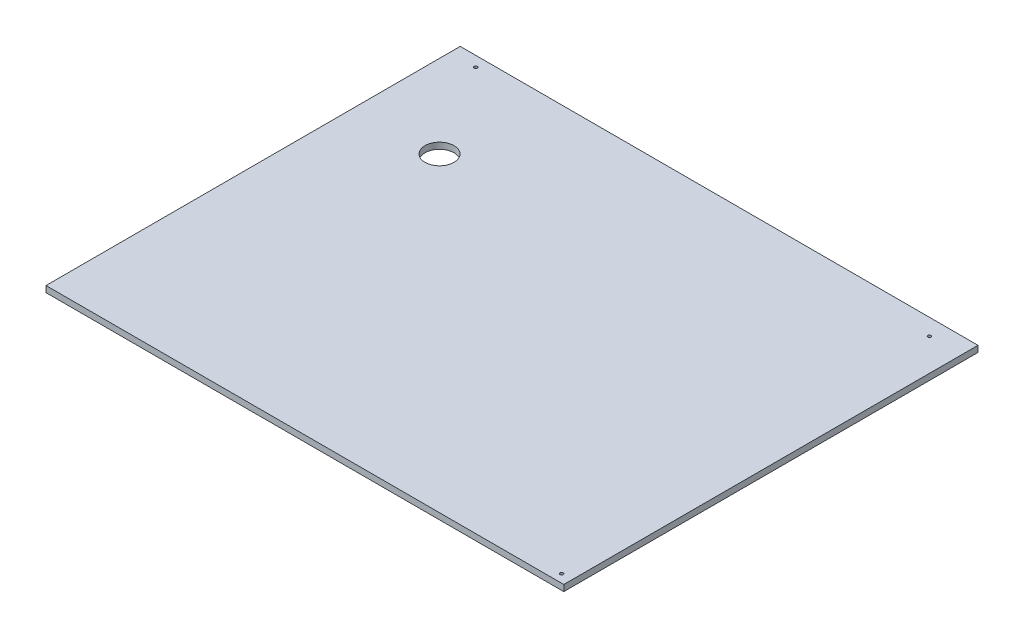
ISO-10303-21;
HEADER;
FILE_DESCRIPTION(('STEP AP214'),'2;1');
FILE_NAME('part.step','',(''),(''),'','','');
FILE_SCHEMA(('AUTOMOTIVE_DESIGN { 1 0 10303 214 1 1 1 1 }'));
ENDSEC;
DATA;
#1=APPLICATION_CONTEXT('core data for automotive mechanical design processes');
#2=APPLICATION_PROTOCOL_DEFINITION('international standard','automotive_design',2000,#1);
#3=PRODUCT_CONTEXT('',#1,'mechanical');
#4=PRODUCT('Part','Part','',(#3));
#5=PRODUCT_RELATED_PRODUCT_CATEGORY('part','',(#4));
#6=PRODUCT_DEFINITION_FORMATION('','',#4);
#7=PRODUCT_DEFINITION_CONTEXT('part definition',#1,'design');
#8=PRODUCT_DEFINITION('design','',#6,#7);
#9=PRODUCT_DEFINITION_SHAPE('','',#8);
#10=(LENGTH_UNIT() NAMED_UNIT(*) SI_UNIT(.MILLI.,.METRE.));
#11=(NAMED_UNIT(*) PLANE_ANGLE_UNIT() SI_UNIT($,.RADIAN.));
#12=(NAMED_UNIT(*) SI_UNIT($,.STERADIAN.) SOLID_ANGLE_UNIT());
#13=UNCERTAINTY_MEASURE_WITH_UNIT(LENGTH_MEASURE(1.E-05),#10,'distance_accuracy_value','');
#14=(GEOMETRIC_REPRESENTATION_CONTEXT(3) GLOBAL_UNCERTAINTY_ASSIGNED_CONTEXT((#13)) GLOBAL_UNIT_ASSIGNED_CONTEXT((#10,
#11,#12)) REPRESENTATION_CONTEXT('',''));
#15=CARTESIAN_POINT('',(0.,0.,0.));
#16=DIRECTION('',(0.,0.,1.));
#17=DIRECTION('',(1.,0.,0.));
#18=AXIS2_PLACEMENT_3D('',#15,#16,#17);
#19=CARTESIAN_POINT('',(0.,6.,0.));
#20=DIRECTION('',(0.,1.,0.));
#21=DIRECTION('',(0.,0.,1.));
#22=AXIS2_PLACEMENT_3D('',#19,#20,#21);
#23=PLANE('',#22);
#24=CARTESIAN_POINT('',(469.,6.,16.));
#25=DIRECTION('',(0.,1.,0.));
#26=DIRECTION('',(0.,0.,1.));
#27=AXIS2_PLACEMENT_3D('',#24,#25,#26);
#28=CIRCLE('',#27,1.50000000000002);
#29=CARTESIAN_POINT('',(469.,6.,17.5));
#30=VERTEX_POINT('',#29);
#31=EDGE_CURVE('E121',#30,#30,#28,.T.);
#32=ORIENTED_EDGE('',*,*,#31,.F.);
#33=EDGE_LOOP('',(#32));
#34=FACE_BOUND('',#33,.T.);
#35=CARTESIAN_POINT('',(25.,6.,10.));
#36=DIRECTION('',(0.,1.,0.));
#37=DIRECTION('',(0.,0.,1.));
#38=AXIS2_PLACEMENT_3D('',#35,#36,#37);
#39=CIRCLE('',#38,1.52499999999999);
#40=CARTESIAN_POINT('',(25.,6.,11.525));
#41=VERTEX_POINT('',#40);
#42=EDGE_CURVE('E100',#41,#41,#39,.T.);
#43=ORIENTED_EDGE('',*,*,#42,.F.);
#44=EDGE_LOOP('',(#43));
#45=FACE_BOUND('',#44,.T.);
#46=DIRECTION('',(0.,0.,1.));
#47=VECTOR('',#46,1.);
#48=CARTESIAN_POINT('',(0.,6.,0.));
#49=LINE('',#48,#47);
#50=CARTESIAN_POINT('',(0.,6.,0.));
#51=VERTEX_POINT('',#50);
#52=CARTESIAN_POINT('',(0.,6.,400.));
#53=VERTEX_POINT('',#52);
#54=EDGE_CURVE('E85',#51,#53,#49,.T.);
#55=ORIENTED_EDGE('',*,*,#54,.T.);
#56=DIRECTION('',(1.,0.,0.));
#57=VECTOR('',#56,1.);
#58=CARTESIAN_POINT('',(0.,6.,400.));
#59=LINE('',#58,#57);
#60=CARTESIAN_POINT('',(500.,6.,400.));
#61=VERTEX_POINT('',#60);
#62=EDGE_CURVE('E80',#53,#61,#59,.T.);
#63=ORIENTED_EDGE('',*,*,#62,.T.);
#64=DIRECTION('',(0.,0.,-1.));
#65=VECTOR('',#64,1.);
#66=CARTESIAN_POINT('',(500.,6.,0.));
#67=LINE('',#66,#65);
#68=CARTESIAN_POINT('',(500.,6.,0.));
#69=VERTEX_POINT('',#68);
#70=EDGE_CURVE('E83',#61,#69,#67,.T.);
#71=ORIENTED_EDGE('',*,*,#70,.T.);
#72=DIRECTION('',(-1.,0.,0.));
#73=VECTOR('',#72,1.);
#74=CARTESIAN_POINT('',(0.,6.,0.));
#75=LINE('',#74,#73);
#76=EDGE_CURVE('E50',#69,#51,#75,.T.);
#77=ORIENTED_EDGE('',*,*,#76,.T.);
#78=EDGE_LOOP('',(#55,#63,#71,#77));
#79=FACE_BOUND('',#78,.T.);
#80=CARTESIAN_POINT('',(490.,6.,392.));
#81=DIRECTION('',(0.,1.,0.));
#82=DIRECTION('',(0.,0.,1.));
#83=AXIS2_PLACEMENT_3D('',#80,#81,#82);
#84=CIRCLE('',#83,1.50000000000002);
#85=CARTESIAN_POINT('',(490.,6.,393.5));
#86=VERTEX_POINT('',#85);
#87=EDGE_CURVE('E115',#86,#86,#84,.T.);
#88=ORIENTED_EDGE('',*,*,#87,.F.);
#89=EDGE_LOOP('',(#88));
#90=FACE_BOUND('',#89,.T.);
#91=CARTESIAN_POINT('',(80.,6.,100.));
#92=DIRECTION('',(0.,1.,0.));
#93=DIRECTION('',(0.,0.,1.));
#94=AXIS2_PLACEMENT_3D('',#91,#92,#93);
#95=CIRCLE('',#94,14.);
#96=CARTESIAN_POINT('',(80.,6.,114.));
#97=VERTEX_POINT('',#96);
#98=EDGE_CURVE('E127',#97,#97,#95,.T.);
#99=ORIENTED_EDGE('',*,*,#98,.F.);
#100=EDGE_LOOP('',(#99));
#101=FACE_BOUND('',#100,.T.);
#102=ADVANCED_FACE('F33',(#34,#45,#79,#90,#101),#23,.T.);
#103=CARTESIAN_POINT('',(0.,0.,0.));
#104=DIRECTION('',(0.,1.,0.));
#105=DIRECTION('',(0.,0.,1.));
#106=AXIS2_PLACEMENT_3D('',#103,#104,#105);
#107=PLANE('',#106);
#108=DIRECTION('',(0.,0.,1.));
#109=VECTOR('',#108,1.);
#110=CARTESIAN_POINT('',(0.,0.,0.));
#111=LINE('',#110,#109);
#112=CARTESIAN_POINT('',(0.,0.,0.));
#113=VERTEX_POINT('',#112);
#114=CARTESIAN_POINT('',(0.,0.,400.));
#115=VERTEX_POINT('',#114);
#116=EDGE_CURVE('E97',#113,#115,#111,.T.);
#117=ORIENTED_EDGE('',*,*,#116,.F.);
#118=DIRECTION('',(-1.,0.,0.));
#119=VECTOR('',#118,1.);
#120=CARTESIAN_POINT('',(0.,0.,0.));
#121=LINE('',#120,#119);
#122=CARTESIAN_POINT('',(500.,0.,0.));
#123=VERTEX_POINT('',#122);
#124=EDGE_CURVE('E73',#123,#113,#121,.T.);
#125=ORIENTED_EDGE('',*,*,#124,.F.);
#126=DIRECTION('',(0.,0.,-1.));
#127=VECTOR('',#126,1.);
#128=CARTESIAN_POINT('',(500.,0.,0.));
#129=LINE('',#128,#127);
#130=CARTESIAN_POINT('',(500.,0.,400.));
#131=VERTEX_POINT('',#130);
#132=EDGE_CURVE('E67',#131,#123,#129,.T.);
#133=ORIENTED_EDGE('',*,*,#132,.F.);
#134=DIRECTION('',(1.,0.,0.));
#135=VECTOR('',#134,1.);
#136=CARTESIAN_POINT('',(0.,0.,400.));
#137=LINE('',#136,#135);
#138=EDGE_CURVE('E89',#115,#131,#137,.T.);
#139=ORIENTED_EDGE('',*,*,#138,.F.);
#140=EDGE_LOOP('',(#117,#125,#133,#139));
#141=FACE_BOUND('',#140,.T.);
#142=CARTESIAN_POINT('',(25.,0.,10.));
#143=DIRECTION('',(0.,1.,0.));
#144=DIRECTION('',(0.,0.,1.));
#145=AXIS2_PLACEMENT_3D('',#142,#143,#144);
#146=CIRCLE('',#145,1.52499999999999);
#147=CARTESIAN_POINT('',(25.,0.,11.525));
#148=VERTEX_POINT('',#147);
#149=EDGE_CURVE('E112',#148,#148,#146,.T.);
#150=ORIENTED_EDGE('',*,*,#149,.T.);
#151=EDGE_LOOP('',(#150));
#152=FACE_BOUND('',#151,.T.);
#153=CARTESIAN_POINT('',(490.,0.,392.));
#154=DIRECTION('',(0.,1.,0.));
#155=DIRECTION('',(0.,0.,1.));
#156=AXIS2_PLACEMENT_3D('',#153,#154,#155);
#157=CIRCLE('',#156,1.50000000000002);
#158=CARTESIAN_POINT('',(490.,0.,393.5));
#159=VERTEX_POINT('',#158);
#160=EDGE_CURVE('E118',#159,#159,#157,.T.);
#161=ORIENTED_EDGE('',*,*,#160,.T.);
#162=EDGE_LOOP('',(#161));
#163=FACE_BOUND('',#162,.T.);
#164=CARTESIAN_POINT('',(469.,0.,16.));
#165=DIRECTION('',(0.,1.,0.));
#166=DIRECTION('',(0.,0.,1.));
#167=AXIS2_PLACEMENT_3D('',#164,#165,#166);
#168=CIRCLE('',#167,1.50000000000002);
#169=CARTESIAN_POINT('',(469.,0.,17.5));
#170=VERTEX_POINT('',#169);
#171=EDGE_CURVE('E124',#170,#170,#168,.T.);
#172=ORIENTED_EDGE('',*,*,#171,.T.);
#173=EDGE_LOOP('',(#172));
#174=FACE_BOUND('',#173,.T.);
#175=CARTESIAN_POINT('',(80.,0.,100.));
#176=DIRECTION('',(0.,1.,0.));
#177=DIRECTION('',(0.,0.,1.));
#178=AXIS2_PLACEMENT_3D('',#175,#176,#177);
#179=CIRCLE('',#178,14.);
#180=CARTESIAN_POINT('',(80.,0.,114.));
#181=VERTEX_POINT('',#180);
#182=EDGE_CURVE('E130',#181,#181,#179,.T.);
#183=ORIENTED_EDGE('',*,*,#182,.T.);
#184=EDGE_LOOP('',(#183));
#185=FACE_BOUND('',#184,.T.);
#186=ADVANCED_FACE('F108',(#141,#152,#163,#174,#185),#107,.F.);
#187=CARTESIAN_POINT('',(0.,6.,0.));
#188=DIRECTION('',(1.,0.,0.));
#189=DIRECTION('',(0.,0.,-1.));
#190=AXIS2_PLACEMENT_3D('',#187,#188,#189);
#191=PLANE('',#190);
#192=ORIENTED_EDGE('',*,*,#116,.T.);
#193=DIRECTION('',(0.,-1.,0.));
#194=VECTOR('',#193,1.);
#195=CARTESIAN_POINT('',(0.,6.,400.));
#196=LINE('',#195,#194);
#197=EDGE_CURVE('E11',#53,#115,#196,.T.);
#198=ORIENTED_EDGE('',*,*,#197,.F.);
#199=ORIENTED_EDGE('',*,*,#54,.F.);
#200=DIRECTION('',(0.,-1.,0.));
#201=VECTOR('',#200,1.);
#202=CARTESIAN_POINT('',(0.,6.,0.));
#203=LINE('',#202,#201);
#204=EDGE_CURVE('E93',#51,#113,#203,.T.);
#205=ORIENTED_EDGE('',*,*,#204,.T.);
#206=EDGE_LOOP('',(#192,#198,#199,#205));
#207=FACE_BOUND('',#206,.T.);
#208=ADVANCED_FACE('F35',(#207),#191,.F.);
#209=CARTESIAN_POINT('',(0.,6.,400.));
#210=DIRECTION('',(0.,0.,-1.));
#211=DIRECTION('',(-1.,0.,0.));
#212=AXIS2_PLACEMENT_3D('',#209,#210,#211);
#213=PLANE('',#212);
#214=ORIENTED_EDGE('',*,*,#138,.T.);
#215=DIRECTION('',(0.,-1.,0.));
#216=VECTOR('',#215,1.);
#217=CARTESIAN_POINT('',(500.,6.,400.));
#218=LINE('',#217,#216);
#219=EDGE_CURVE('E42',#61,#131,#218,.T.);
#220=ORIENTED_EDGE('',*,*,#219,.F.);
#221=ORIENTED_EDGE('',*,*,#62,.F.);
#222=ORIENTED_EDGE('',*,*,#197,.T.);
#223=EDGE_LOOP('',(#214,#220,#221,#222));
#224=FACE_BOUND('',#223,.T.);
#225=ADVANCED_FACE('F88',(#224),#213,.F.);
#226=CARTESIAN_POINT('',(500.,6.,0.));
#227=DIRECTION('',(-1.,0.,0.));
#228=DIRECTION('',(0.,0.,1.));
#229=AXIS2_PLACEMENT_3D('',#226,#227,#228);
#230=PLANE('',#229);
#231=ORIENTED_EDGE('',*,*,#132,.T.);
#232=DIRECTION('',(0.,-1.,0.));
#233=VECTOR('',#232,1.);
#234=CARTESIAN_POINT('',(500.,6.,0.));
#235=LINE('',#234,#233);
#236=EDGE_CURVE('E90',#69,#123,#235,.T.);
#237=ORIENTED_EDGE('',*,*,#236,.F.);
#238=ORIENTED_EDGE('',*,*,#70,.F.);
#239=ORIENTED_EDGE('',*,*,#219,.T.);
#240=EDGE_LOOP('',(#231,#237,#238,#239));
#241=FACE_BOUND('',#240,.T.);
#242=ADVANCED_FACE('F91',(#241),#230,.F.);
#243=CARTESIAN_POINT('',(0.,6.,0.));
#244=DIRECTION('',(0.,0.,1.));
#245=DIRECTION('',(1.,0.,0.));
#246=AXIS2_PLACEMENT_3D('',#243,#244,#245);
#247=PLANE('',#246);
#248=ORIENTED_EDGE('',*,*,#124,.T.);
#249=ORIENTED_EDGE('',*,*,#204,.F.);
#250=ORIENTED_EDGE('',*,*,#76,.F.);
#251=ORIENTED_EDGE('',*,*,#236,.T.);
#252=EDGE_LOOP('',(#248,#249,#250,#251));
#253=FACE_BOUND('',#252,.T.);
#254=ADVANCED_FACE('F105',(#253),#247,.F.);
#255=CARTESIAN_POINT('',(25.,6.,10.));
#256=DIRECTION('',(0.,-1.,0.));
#257=DIRECTION('',(0.,0.,-1.));
#258=AXIS2_PLACEMENT_3D('',#255,#256,#257);
#259=CYLINDRICAL_SURFACE('',#258,1.52499999999999);
#260=ORIENTED_EDGE('',*,*,#42,.T.);
#261=EDGE_LOOP('',(#260));
#262=FACE_BOUND('',#261,.T.);
#263=ORIENTED_EDGE('',*,*,#149,.F.);
#264=EDGE_LOOP('',(#263));
#265=FACE_BOUND('',#264,.T.);
#266=ADVANCED_FACE('F149',(#262,#265),#259,.F.);
#267=CARTESIAN_POINT('',(490.,6.,392.));
#268=DIRECTION('',(0.,-1.,0.));
#269=DIRECTION('',(0.,0.,-1.));
#270=AXIS2_PLACEMENT_3D('',#267,#268,#269);
#271=CYLINDRICAL_SURFACE('',#270,1.50000000000002);
#272=ORIENTED_EDGE('',*,*,#87,.T.);
#273=EDGE_LOOP('',(#272));
#274=FACE_BOUND('',#273,.T.);
#275=ORIENTED_EDGE('',*,*,#160,.F.);
#276=EDGE_LOOP('',(#275));
#277=FACE_BOUND('',#276,.T.);
#278=ADVANCED_FACE('F195',(#274,#277),#271,.F.);
#279=CARTESIAN_POINT('',(469.,6.,16.));
#280=DIRECTION('',(0.,-1.,0.));
#281=DIRECTION('',(0.,0.,-1.));
#282=AXIS2_PLACEMENT_3D('',#279,#280,#281);
#283=CYLINDRICAL_SURFACE('',#282,1.50000000000002);
#284=ORIENTED_EDGE('',*,*,#31,.T.);
#285=EDGE_LOOP('',(#284));
#286=FACE_BOUND('',#285,.T.);
#287=ORIENTED_EDGE('',*,*,#171,.F.);
#288=EDGE_LOOP('',(#287));
#289=FACE_BOUND('',#288,.T.);
#290=ADVANCED_FACE('F203',(#286,#289),#283,.F.);
#291=CARTESIAN_POINT('',(80.,6.,100.));
#292=DIRECTION('',(0.,-1.,0.));
#293=DIRECTION('',(0.,0.,-1.));
#294=AXIS2_PLACEMENT_3D('',#291,#292,#293);
#295=CYLINDRICAL_SURFACE('',#294,14.);
#296=ORIENTED_EDGE('',*,*,#98,.T.);
#297=EDGE_LOOP('',(#296));
#298=FACE_BOUND('',#297,.T.);
#299=ORIENTED_EDGE('',*,*,#182,.F.);
#300=EDGE_LOOP('',(#299));
#301=FACE_BOUND('',#300,.T.);
#302=ADVANCED_FACE('F136',(#298,#301),#295,.F.);
#303=CLOSED_SHELL('',(#102,#186,#208,#225,#242,#254,#266,#278,#290,#302));
#304=MANIFOLD_SOLID_BREP('B2',#303);
#305=ADVANCED_BREP_SHAPE_REPRESENTATION('',(#18,#304),#14);
#306=SHAPE_DEFINITION_REPRESENTATION(#9,#305);
ENDSEC;
END-ISO-10303-21;
